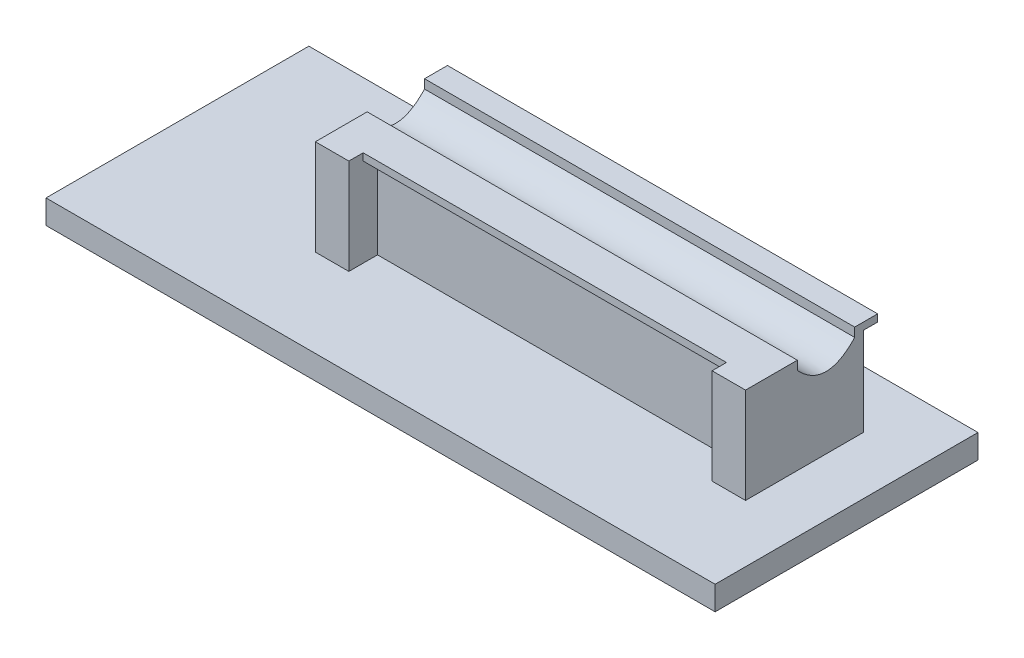
ISO-10303-21;
HEADER;
FILE_DESCRIPTION(('STEP AP214'),'2;1');
FILE_NAME('part.step','',(''),(''),'','','');
FILE_SCHEMA(('AUTOMOTIVE_DESIGN { 1 0 10303 214 1 1 1 1 }'));
ENDSEC;
DATA;
#1=APPLICATION_CONTEXT('core data for automotive mechanical design processes');
#2=APPLICATION_PROTOCOL_DEFINITION('international standard','automotive_design',2000,#1);
#3=PRODUCT_CONTEXT('',#1,'mechanical');
#4=PRODUCT('Part','Part','',(#3));
#5=PRODUCT_RELATED_PRODUCT_CATEGORY('part','',(#4));
#6=PRODUCT_DEFINITION_FORMATION('','',#4);
#7=PRODUCT_DEFINITION_CONTEXT('part definition',#1,'design');
#8=PRODUCT_DEFINITION('design','',#6,#7);
#9=PRODUCT_DEFINITION_SHAPE('','',#8);
#10=(LENGTH_UNIT() NAMED_UNIT(*) SI_UNIT(.MILLI.,.METRE.));
#11=(NAMED_UNIT(*) PLANE_ANGLE_UNIT() SI_UNIT($,.RADIAN.));
#12=(NAMED_UNIT(*) SI_UNIT($,.STERADIAN.) SOLID_ANGLE_UNIT());
#13=UNCERTAINTY_MEASURE_WITH_UNIT(LENGTH_MEASURE(1.E-05),#10,'distance_accuracy_value','');
#14=(GEOMETRIC_REPRESENTATION_CONTEXT(3) GLOBAL_UNCERTAINTY_ASSIGNED_CONTEXT((#13)) GLOBAL_UNIT_ASSIGNED_CONTEXT((#10,
#11,#12)) REPRESENTATION_CONTEXT('',''));
#15=CARTESIAN_POINT('',(0.,0.,0.));
#16=DIRECTION('',(0.,0.,1.));
#17=DIRECTION('',(1.,0.,0.));
#18=AXIS2_PLACEMENT_3D('',#15,#16,#17);
#19=CARTESIAN_POINT('',(-900.,100.,93.185));
#20=DIRECTION('',(0.,0.,1.));
#21=DIRECTION('',(0.,-1.,0.));
#22=AXIS2_PLACEMENT_3D('',#19,#20,#21);
#23=PLANE('',#22);
#24=DIRECTION('',(0.,-1.,0.));
#25=VECTOR('',#24,1.);
#26=CARTESIAN_POINT('',(-70.0000000000001,100.,93.185));
#27=LINE('',#26,#25);
#28=CARTESIAN_POINT('',(-70.0000000000001,85.,93.185));
#29=VERTEX_POINT('',#28);
#30=CARTESIAN_POINT('',(-70.,-100.,93.185));
#31=VERTEX_POINT('',#30);
#32=EDGE_CURVE('E387',#29,#31,#27,.T.);
#33=ORIENTED_EDGE('',*,*,#32,.F.);
#34=DIRECTION('',(1.,0.,0.));
#35=VECTOR('',#34,1.);
#36=CARTESIAN_POINT('',(-830.,85.,93.185));
#37=LINE('',#36,#35);
#38=CARTESIAN_POINT('',(-830.,85.,93.185));
#39=VERTEX_POINT('',#38);
#40=EDGE_CURVE('E200',#39,#29,#37,.T.);
#41=ORIENTED_EDGE('',*,*,#40,.F.);
#42=DIRECTION('',(0.,1.,0.));
#43=VECTOR('',#42,1.);
#44=CARTESIAN_POINT('',(-830.,100.,93.185));
#45=LINE('',#44,#43);
#46=CARTESIAN_POINT('',(-830.,-100.,93.185));
#47=VERTEX_POINT('',#46);
#48=EDGE_CURVE('E205',#47,#39,#45,.T.);
#49=ORIENTED_EDGE('',*,*,#48,.F.);
#50=DIRECTION('',(1.,0.,0.));
#51=VECTOR('',#50,1.);
#52=CARTESIAN_POINT('',(-900.,-100.,93.185));
#53=LINE('',#52,#51);
#54=EDGE_CURVE('E48',#47,#31,#53,.T.);
#55=ORIENTED_EDGE('',*,*,#54,.T.);
#56=EDGE_LOOP('',(#33,#41,#49,#55));
#57=FACE_BOUND('',#56,.T.);
#58=ADVANCED_FACE('F44',(#57),#23,.T.);
#59=CARTESIAN_POINT('',(-70.0000000000001,100.,153.185));
#60=DIRECTION('',(1.,0.,0.));
#61=DIRECTION('',(0.,1.,0.));
#62=AXIS2_PLACEMENT_3D('',#59,#60,#61);
#63=PLANE('',#62);
#64=DIRECTION('',(0.,0.,-1.));
#65=VECTOR('',#64,1.);
#66=CARTESIAN_POINT('',(-70.0000000000001,85.,123.185));
#67=LINE('',#66,#65);
#68=CARTESIAN_POINT('',(-70.0000000000001,85.,123.185));
#69=VERTEX_POINT('',#68);
#70=EDGE_CURVE('E189',#69,#29,#67,.T.);
#71=ORIENTED_EDGE('',*,*,#70,.T.);
#72=ORIENTED_EDGE('',*,*,#32,.T.);
#73=DIRECTION('',(0.,0.,-1.));
#74=VECTOR('',#73,1.);
#75=CARTESIAN_POINT('',(-70.,-100.,153.185));
#76=LINE('',#75,#74);
#77=CARTESIAN_POINT('',(-70.,-100.,153.185));
#78=VERTEX_POINT('',#77);
#79=EDGE_CURVE('E358',#78,#31,#76,.T.);
#80=ORIENTED_EDGE('',*,*,#79,.F.);
#81=DIRECTION('',(0.,-1.,0.));
#82=VECTOR('',#81,1.);
#83=CARTESIAN_POINT('',(-70.0000000000001,100.,153.185));
#84=LINE('',#83,#82);
#85=CARTESIAN_POINT('',(-70.0000000000001,100.,153.185));
#86=VERTEX_POINT('',#85);
#87=EDGE_CURVE('E393',#86,#78,#84,.T.);
#88=ORIENTED_EDGE('',*,*,#87,.F.);
#89=DIRECTION('',(0.,0.,-1.));
#90=VECTOR('',#89,1.);
#91=CARTESIAN_POINT('',(-70.0000000000001,100.,153.185));
#92=LINE('',#91,#90);
#93=CARTESIAN_POINT('',(-70.0000000000001,100.,123.185));
#94=VERTEX_POINT('',#93);
#95=EDGE_CURVE('E404',#86,#94,#92,.T.);
#96=ORIENTED_EDGE('',*,*,#95,.T.);
#97=DIRECTION('',(0.,1.,0.));
#98=VECTOR('',#97,1.);
#99=CARTESIAN_POINT('',(-70.0000000000001,100.,123.185));
#100=LINE('',#99,#98);
#101=EDGE_CURVE('E192',#69,#94,#100,.T.);
#102=ORIENTED_EDGE('',*,*,#101,.F.);
#103=EDGE_LOOP('',(#71,#72,#80,#88,#96,#102));
#104=FACE_BOUND('',#103,.T.);
#105=ADVANCED_FACE('F295',(#104),#63,.F.);
#106=CARTESIAN_POINT('',(-830.,100.,153.185));
#107=DIRECTION('',(-1.,0.,0.));
#108=DIRECTION('',(0.,0.,1.));
#109=AXIS2_PLACEMENT_3D('',#106,#107,#108);
#110=PLANE('',#109);
#111=DIRECTION('',(0.,0.,-1.));
#112=VECTOR('',#111,1.);
#113=CARTESIAN_POINT('',(-830.,85.,123.185));
#114=LINE('',#113,#112);
#115=CARTESIAN_POINT('',(-830.,85.,123.185));
#116=VERTEX_POINT('',#115);
#117=EDGE_CURVE('E186',#116,#39,#114,.T.);
#118=ORIENTED_EDGE('',*,*,#117,.F.);
#119=DIRECTION('',(0.,-1.,0.));
#120=VECTOR('',#119,1.);
#121=CARTESIAN_POINT('',(-830.,100.,123.185));
#122=LINE('',#121,#120);
#123=CARTESIAN_POINT('',(-830.,100.,123.185));
#124=VERTEX_POINT('',#123);
#125=EDGE_CURVE('E193',#124,#116,#122,.T.);
#126=ORIENTED_EDGE('',*,*,#125,.F.);
#127=DIRECTION('',(0.,0.,-1.));
#128=VECTOR('',#127,1.);
#129=CARTESIAN_POINT('',(-830.,100.,153.185));
#130=LINE('',#129,#128);
#131=CARTESIAN_POINT('',(-830.,100.,153.185));
#132=VERTEX_POINT('',#131);
#133=EDGE_CURVE('E424',#132,#124,#130,.T.);
#134=ORIENTED_EDGE('',*,*,#133,.F.);
#135=DIRECTION('',(0.,1.,0.));
#136=VECTOR('',#135,1.);
#137=CARTESIAN_POINT('',(-830.,100.,153.185));
#138=LINE('',#137,#136);
#139=CARTESIAN_POINT('',(-830.,-100.,153.185));
#140=VERTEX_POINT('',#139);
#141=EDGE_CURVE('E389',#140,#132,#138,.T.);
#142=ORIENTED_EDGE('',*,*,#141,.F.);
#143=DIRECTION('',(0.,0.,-1.));
#144=VECTOR('',#143,1.);
#145=CARTESIAN_POINT('',(-830.,-100.,153.185));
#146=LINE('',#145,#144);
#147=EDGE_CURVE('E422',#140,#47,#146,.T.);
#148=ORIENTED_EDGE('',*,*,#147,.T.);
#149=ORIENTED_EDGE('',*,*,#48,.T.);
#150=EDGE_LOOP('',(#118,#126,#134,#142,#148,#149));
#151=FACE_BOUND('',#150,.T.);
#152=ADVANCED_FACE('F203',(#151),#110,.F.);
#153=CARTESIAN_POINT('',(-900.,100.,-93.185));
#154=DIRECTION('',(0.,0.,-1.));
#155=DIRECTION('',(0.,1.,0.));
#156=AXIS2_PLACEMENT_3D('',#153,#154,#155);
#157=PLANE('',#156);
#158=DIRECTION('',(0.,1.,0.));
#159=VECTOR('',#158,1.);
#160=CARTESIAN_POINT('',(-900.,100.,-93.185));
#161=LINE('',#160,#159);
#162=CARTESIAN_POINT('',(-900.,-100.,-93.185));
#163=VERTEX_POINT('',#162);
#164=CARTESIAN_POINT('',(-900.,85.,-93.185));
#165=VERTEX_POINT('',#164);
#166=EDGE_CURVE('E339',#163,#165,#161,.T.);
#167=ORIENTED_EDGE('',*,*,#166,.T.);
#168=DIRECTION('',(-1.,0.,0.));
#169=VECTOR('',#168,1.);
#170=CARTESIAN_POINT('',(0.,85.,-93.185));
#171=LINE('',#170,#169);
#172=CARTESIAN_POINT('',(0.,85.,-93.185));
#173=VERTEX_POINT('',#172);
#174=EDGE_CURVE('E207',#173,#165,#171,.T.);
#175=ORIENTED_EDGE('',*,*,#174,.F.);
#176=DIRECTION('',(0.,1.,0.));
#177=VECTOR('',#176,1.);
#178=CARTESIAN_POINT('',(0.,100.,-93.185));
#179=LINE('',#178,#177);
#180=CARTESIAN_POINT('',(0.,-100.,-93.185));
#181=VERTEX_POINT('',#180);
#182=EDGE_CURVE('E354',#181,#173,#179,.T.);
#183=ORIENTED_EDGE('',*,*,#182,.F.);
#184=DIRECTION('',(1.,0.,0.));
#185=VECTOR('',#184,1.);
#186=CARTESIAN_POINT('',(-900.,-100.,-93.185));
#187=LINE('',#186,#185);
#188=EDGE_CURVE('E11',#163,#181,#187,.T.);
#189=ORIENTED_EDGE('',*,*,#188,.F.);
#190=EDGE_LOOP('',(#167,#175,#183,#189));
#191=FACE_BOUND('',#190,.T.);
#192=ADVANCED_FACE('F46',(#191),#157,.T.);
#193=CARTESIAN_POINT('',(-900.,100.,93.185));
#194=DIRECTION('',(0.,1.,0.));
#195=DIRECTION('',(0.,0.,1.));
#196=AXIS2_PLACEMENT_3D('',#193,#194,#195);
#197=PLANE('',#196);
#198=DIRECTION('',(1.,0.,0.));
#199=VECTOR('',#198,1.);
#200=CARTESIAN_POINT('',(-900.,100.,-75.185));
#201=LINE('',#200,#199);
#202=CARTESIAN_POINT('',(-900.,100.,-75.185));
#203=VERTEX_POINT('',#202);
#204=CARTESIAN_POINT('',(0.,100.,-75.185));
#205=VERTEX_POINT('',#204);
#206=EDGE_CURVE('E480',#203,#205,#201,.T.);
#207=ORIENTED_EDGE('',*,*,#206,.T.);
#208=DIRECTION('',(0.,0.,1.));
#209=VECTOR('',#208,1.);
#210=CARTESIAN_POINT('',(0.,100.,93.185));
#211=LINE('',#210,#209);
#212=CARTESIAN_POINT('',(0.,100.,-123.185));
#213=VERTEX_POINT('',#212);
#214=EDGE_CURVE('E359',#213,#205,#211,.T.);
#215=ORIENTED_EDGE('',*,*,#214,.F.);
#216=DIRECTION('',(1.,0.,0.));
#217=VECTOR('',#216,1.);
#218=CARTESIAN_POINT('',(0.,100.,-123.185));
#219=LINE('',#218,#217);
#220=CARTESIAN_POINT('',(-900.,100.,-123.185));
#221=VERTEX_POINT('',#220);
#222=EDGE_CURVE('E227',#221,#213,#219,.T.);
#223=ORIENTED_EDGE('',*,*,#222,.F.);
#224=DIRECTION('',(0.,0.,1.));
#225=VECTOR('',#224,1.);
#226=CARTESIAN_POINT('',(-900.,100.,93.185));
#227=LINE('',#226,#225);
#228=EDGE_CURVE('E338',#221,#203,#227,.T.);
#229=ORIENTED_EDGE('',*,*,#228,.T.);
#230=EDGE_LOOP('',(#207,#215,#223,#229));
#231=FACE_BOUND('',#230,.T.);
#232=ADVANCED_FACE('F318',(#231),#197,.T.);
#233=DIRECTION('',(1.,0.,0.));
#234=VECTOR('',#233,1.);
#235=CARTESIAN_POINT('',(-900.,100.,44.815));
#236=LINE('',#235,#234);
#237=CARTESIAN_POINT('',(-900.,100.,44.815));
#238=VERTEX_POINT('',#237);
#239=CARTESIAN_POINT('',(0.,100.,44.815));
#240=VERTEX_POINT('',#239);
#241=EDGE_CURVE('E68',#238,#240,#236,.T.);
#242=ORIENTED_EDGE('',*,*,#241,.F.);
#243=CARTESIAN_POINT('',(-900.,100.,153.185));
#244=VERTEX_POINT('',#243);
#245=EDGE_CURVE('E327',#238,#244,#227,.T.);
#246=ORIENTED_EDGE('',*,*,#245,.T.);
#247=DIRECTION('',(-1.,0.,0.));
#248=VECTOR('',#247,1.);
#249=CARTESIAN_POINT('',(-900.,100.,153.185));
#250=LINE('',#249,#248);
#251=EDGE_CURVE('E381',#132,#244,#250,.T.);
#252=ORIENTED_EDGE('',*,*,#251,.F.);
#253=ORIENTED_EDGE('',*,*,#133,.T.);
#254=DIRECTION('',(-1.,0.,0.));
#255=VECTOR('',#254,1.);
#256=CARTESIAN_POINT('',(-830.,100.,123.185));
#257=LINE('',#256,#255);
#258=EDGE_CURVE('E60',#94,#124,#257,.T.);
#259=ORIENTED_EDGE('',*,*,#258,.F.);
#260=ORIENTED_EDGE('',*,*,#95,.F.);
#261=DIRECTION('',(-1.,0.,0.));
#262=VECTOR('',#261,1.);
#263=CARTESIAN_POINT('',(-70.0000000000001,100.,153.185));
#264=LINE('',#263,#262);
#265=CARTESIAN_POINT('',(0.,100.,153.185));
#266=VERTEX_POINT('',#265);
#267=EDGE_CURVE('E401',#266,#86,#264,.T.);
#268=ORIENTED_EDGE('',*,*,#267,.F.);
#269=EDGE_CURVE('E330',#240,#266,#211,.T.);
#270=ORIENTED_EDGE('',*,*,#269,.F.);
#271=EDGE_LOOP('',(#242,#246,#252,#253,#259,#260,#268,#270));
#272=FACE_BOUND('',#271,.T.);
#273=ADVANCED_FACE('F310',(#272),#197,.T.);
#274=CARTESIAN_POINT('',(-900.,0.,0.));
#275=DIRECTION('',(1.,0.,0.));
#276=DIRECTION('',(0.,0.,-1.));
#277=AXIS2_PLACEMENT_3D('',#274,#275,#276);
#278=PLANE('',#277);
#279=CARTESIAN_POINT('',(-900.,81.2420917557449,44.815));
#280=CARTESIAN_POINT('',(-900.,17.3998710259146,-15.185));
#281=CARTESIAN_POINT('',(-900.,81.2420917557449,-75.185));
#282=B_SPLINE_CURVE_WITH_KNOTS('',2,(#279,#280,#281),.UNSPECIFIED.,.F.,.F.,(3,3),(0.,1.),.UNSPECIFIED.);
#283=CARTESIAN_POINT('',(-900.,81.2420917557449,44.815));
#284=VERTEX_POINT('',#283);
#285=CARTESIAN_POINT('',(-900.,81.2420917557449,-75.185));
#286=VERTEX_POINT('',#285);
#287=EDGE_CURVE('E243',#284,#286,#282,.T.);
#288=ORIENTED_EDGE('',*,*,#287,.T.);
#289=DIRECTION('',(0.,1.,0.));
#290=VECTOR('',#289,1.);
#291=CARTESIAN_POINT('',(-900.,100.,-75.185));
#292=LINE('',#291,#290);
#293=EDGE_CURVE('E251',#286,#203,#292,.T.);
#294=ORIENTED_EDGE('',*,*,#293,.T.);
#295=ORIENTED_EDGE('',*,*,#228,.F.);
#296=DIRECTION('',(0.,1.,0.));
#297=VECTOR('',#296,1.);
#298=CARTESIAN_POINT('',(-900.,100.,-123.185));
#299=LINE('',#298,#297);
#300=CARTESIAN_POINT('',(-900.,85.,-123.185));
#301=VERTEX_POINT('',#300);
#302=EDGE_CURVE('E223',#301,#221,#299,.T.);
#303=ORIENTED_EDGE('',*,*,#302,.F.);
#304=DIRECTION('',(0.,0.,1.));
#305=VECTOR('',#304,1.);
#306=CARTESIAN_POINT('',(-900.,85.,-123.185));
#307=LINE('',#306,#305);
#308=EDGE_CURVE('E230',#301,#165,#307,.T.);
#309=ORIENTED_EDGE('',*,*,#308,.T.);
#310=ORIENTED_EDGE('',*,*,#166,.F.);
#311=DIRECTION('',(0.,0.,-1.));
#312=VECTOR('',#311,1.);
#313=CARTESIAN_POINT('',(-900.,-100.,93.185));
#314=LINE('',#313,#312);
#315=CARTESIAN_POINT('',(-900.,-100.,153.185));
#316=VERTEX_POINT('',#315);
#317=EDGE_CURVE('E345',#316,#163,#314,.T.);
#318=ORIENTED_EDGE('',*,*,#317,.F.);
#319=DIRECTION('',(0.,-1.,0.));
#320=VECTOR('',#319,1.);
#321=CARTESIAN_POINT('',(-900.,100.,153.185));
#322=LINE('',#321,#320);
#323=EDGE_CURVE('E336',#244,#316,#322,.T.);
#324=ORIENTED_EDGE('',*,*,#323,.F.);
#325=ORIENTED_EDGE('',*,*,#245,.F.);
#326=DIRECTION('',(0.,-1.,0.));
#327=VECTOR('',#326,1.);
#328=CARTESIAN_POINT('',(-900.,100.,44.815));
#329=LINE('',#328,#327);
#330=EDGE_CURVE('E239',#238,#284,#329,.T.);
#331=ORIENTED_EDGE('',*,*,#330,.T.);
#332=EDGE_LOOP('',(#288,#294,#295,#303,#309,#310,#318,#324,#325,#331));
#333=FACE_BOUND('',#332,.T.);
#334=ADVANCED_FACE('F307',(#333),#278,.F.);
#335=CARTESIAN_POINT('',(0.,0.,0.));
#336=DIRECTION('',(1.,0.,0.));
#337=DIRECTION('',(0.,0.,-1.));
#338=AXIS2_PLACEMENT_3D('',#335,#336,#337);
#339=PLANE('',#338);
#340=DIRECTION('',(0.,1.,0.));
#341=VECTOR('',#340,1.);
#342=CARTESIAN_POINT('',(0.,100.,-75.185));
#343=LINE('',#342,#341);
#344=CARTESIAN_POINT('',(0.,81.2420917557449,-75.185));
#345=VERTEX_POINT('',#344);
#346=EDGE_CURVE('E244',#345,#205,#343,.T.);
#347=ORIENTED_EDGE('',*,*,#346,.F.);
#348=CARTESIAN_POINT('',(0.,81.2420917557449,44.815));
#349=CARTESIAN_POINT('',(0.,17.3998710259146,-15.185));
#350=CARTESIAN_POINT('',(0.,81.2420917557449,-75.185));
#351=B_SPLINE_CURVE_WITH_KNOTS('',2,(#348,#349,#350),.UNSPECIFIED.,.F.,.F.,(3,3),(0.,1.),.UNSPECIFIED.);
#352=CARTESIAN_POINT('',(0.,81.2420917557449,44.815));
#353=VERTEX_POINT('',#352);
#354=EDGE_CURVE('E502',#353,#345,#351,.T.);
#355=ORIENTED_EDGE('',*,*,#354,.F.);
#356=DIRECTION('',(0.,-1.,0.));
#357=VECTOR('',#356,1.);
#358=CARTESIAN_POINT('',(0.,100.,44.815));
#359=LINE('',#358,#357);
#360=EDGE_CURVE('E238',#240,#353,#359,.T.);
#361=ORIENTED_EDGE('',*,*,#360,.F.);
#362=ORIENTED_EDGE('',*,*,#269,.T.);
#363=DIRECTION('',(0.,1.,0.));
#364=VECTOR('',#363,1.);
#365=CARTESIAN_POINT('',(0.,100.,153.185));
#366=LINE('',#365,#364);
#367=CARTESIAN_POINT('',(0.,-100.,153.185));
#368=VERTEX_POINT('',#367);
#369=EDGE_CURVE('E371',#368,#266,#366,.T.);
#370=ORIENTED_EDGE('',*,*,#369,.F.);
#371=DIRECTION('',(0.,0.,-1.));
#372=VECTOR('',#371,1.);
#373=CARTESIAN_POINT('',(0.,-100.,93.185));
#374=LINE('',#373,#372);
#375=EDGE_CURVE('E347',#368,#181,#374,.T.);
#376=ORIENTED_EDGE('',*,*,#375,.T.);
#377=ORIENTED_EDGE('',*,*,#182,.T.);
#378=DIRECTION('',(0.,0.,1.));
#379=VECTOR('',#378,1.);
#380=CARTESIAN_POINT('',(0.,85.,-123.185));
#381=LINE('',#380,#379);
#382=CARTESIAN_POINT('',(0.,85.,-123.185));
#383=VERTEX_POINT('',#382);
#384=EDGE_CURVE('E235',#383,#173,#381,.T.);
#385=ORIENTED_EDGE('',*,*,#384,.F.);
#386=DIRECTION('',(0.,-1.,0.));
#387=VECTOR('',#386,1.);
#388=CARTESIAN_POINT('',(0.,100.,-123.185));
#389=LINE('',#388,#387);
#390=EDGE_CURVE('E212',#213,#383,#389,.T.);
#391=ORIENTED_EDGE('',*,*,#390,.F.);
#392=ORIENTED_EDGE('',*,*,#214,.T.);
#393=EDGE_LOOP('',(#347,#355,#361,#362,#370,#376,#377,#385,#391,#392));
#394=FACE_BOUND('',#393,.T.);
#395=ADVANCED_FACE('F302',(#394),#339,.T.);
#396=CARTESIAN_POINT('',(0.,0.,153.185));
#397=DIRECTION('',(0.,0.,1.));
#398=DIRECTION('',(1.,0.,0.));
#399=AXIS2_PLACEMENT_3D('',#396,#397,#398);
#400=PLANE('',#399);
#401=ORIENTED_EDGE('',*,*,#87,.T.);
#402=DIRECTION('',(1.,0.,0.));
#403=VECTOR('',#402,1.);
#404=CARTESIAN_POINT('',(-70.,-100.,153.185));
#405=LINE('',#404,#403);
#406=EDGE_CURVE('E396',#78,#368,#405,.T.);
#407=ORIENTED_EDGE('',*,*,#406,.T.);
#408=ORIENTED_EDGE('',*,*,#369,.T.);
#409=ORIENTED_EDGE('',*,*,#267,.T.);
#410=EDGE_LOOP('',(#401,#407,#408,#409));
#411=FACE_BOUND('',#410,.T.);
#412=ADVANCED_FACE('F298',(#411),#400,.T.);
#413=CARTESIAN_POINT('',(0.,0.,153.185));
#414=DIRECTION('',(0.,0.,1.));
#415=DIRECTION('',(1.,0.,0.));
#416=AXIS2_PLACEMENT_3D('',#413,#414,#415);
#417=PLANE('',#416);
#418=ORIENTED_EDGE('',*,*,#323,.T.);
#419=DIRECTION('',(1.,0.,0.));
#420=VECTOR('',#419,1.);
#421=CARTESIAN_POINT('',(-900.,-100.,153.185));
#422=LINE('',#421,#420);
#423=EDGE_CURVE('E379',#316,#140,#422,.T.);
#424=ORIENTED_EDGE('',*,*,#423,.T.);
#425=ORIENTED_EDGE('',*,*,#141,.T.);
#426=ORIENTED_EDGE('',*,*,#251,.T.);
#427=EDGE_LOOP('',(#418,#424,#425,#426));
#428=FACE_BOUND('',#427,.T.);
#429=ADVANCED_FACE('F277',(#428),#417,.T.);
#430=CARTESIAN_POINT('',(0.,-100.,0.));
#431=DIRECTION('',(0.,1.,0.));
#432=DIRECTION('',(0.,0.,1.));
#433=AXIS2_PLACEMENT_3D('',#430,#431,#432);
#434=PLANE('',#433);
#435=DIRECTION('',(1.,0.,0.));
#436=VECTOR('',#435,1.);
#437=CARTESIAN_POINT('',(120.,-100.,-213.185));
#438=LINE('',#437,#436);
#439=CARTESIAN_POINT('',(-1280.,-100.,-213.185));
#440=VERTEX_POINT('',#439);
#441=CARTESIAN_POINT('',(120.,-100.,-213.185));
#442=VERTEX_POINT('',#441);
#443=EDGE_CURVE('E476',#440,#442,#438,.T.);
#444=ORIENTED_EDGE('',*,*,#443,.F.);
#445=DIRECTION('',(0.,0.,-1.));
#446=VECTOR('',#445,1.);
#447=CARTESIAN_POINT('',(-1280.,-100.,-213.185));
#448=LINE('',#447,#446);
#449=CARTESIAN_POINT('',(-1280.,-100.,336.815));
#450=VERTEX_POINT('',#449);
#451=EDGE_CURVE('E466',#450,#440,#448,.T.);
#452=ORIENTED_EDGE('',*,*,#451,.F.);
#453=DIRECTION('',(-1.,0.,0.));
#454=VECTOR('',#453,1.);
#455=CARTESIAN_POINT('',(-1280.,-100.,336.815));
#456=LINE('',#455,#454);
#457=CARTESIAN_POINT('',(120.,-100.,336.815));
#458=VERTEX_POINT('',#457);
#459=EDGE_CURVE('E470',#458,#450,#456,.T.);
#460=ORIENTED_EDGE('',*,*,#459,.F.);
#461=DIRECTION('',(0.,0.,1.));
#462=VECTOR('',#461,1.);
#463=CARTESIAN_POINT('',(120.,-100.,336.815));
#464=LINE('',#463,#462);
#465=EDGE_CURVE('E473',#442,#458,#464,.T.);
#466=ORIENTED_EDGE('',*,*,#465,.F.);
#467=EDGE_LOOP('',(#444,#452,#460,#466));
#468=FACE_BOUND('',#467,.T.);
#469=ORIENTED_EDGE('',*,*,#375,.F.);
#470=ORIENTED_EDGE('',*,*,#406,.F.);
#471=ORIENTED_EDGE('',*,*,#79,.T.);
#472=ORIENTED_EDGE('',*,*,#54,.F.);
#473=ORIENTED_EDGE('',*,*,#147,.F.);
#474=ORIENTED_EDGE('',*,*,#423,.F.);
#475=ORIENTED_EDGE('',*,*,#317,.T.);
#476=ORIENTED_EDGE('',*,*,#188,.T.);
#477=EDGE_LOOP('',(#469,#470,#471,#472,#473,#474,#475,#476));
#478=FACE_BOUND('',#477,.T.);
#479=ADVANCED_FACE('F273',(#468,#478),#434,.T.);
#480=CARTESIAN_POINT('',(120.,-150.,-213.185));
#481=DIRECTION('',(0.,0.,1.));
#482=DIRECTION('',(1.,0.,0.));
#483=AXIS2_PLACEMENT_3D('',#480,#481,#482);
#484=PLANE('',#483);
#485=ORIENTED_EDGE('',*,*,#443,.T.);
#486=DIRECTION('',(0.,1.,0.));
#487=VECTOR('',#486,1.);
#488=CARTESIAN_POINT('',(120.,-150.,-213.185));
#489=LINE('',#488,#487);
#490=CARTESIAN_POINT('',(120.,-150.,-213.185));
#491=VERTEX_POINT('',#490);
#492=EDGE_CURVE('E425',#491,#442,#489,.T.);
#493=ORIENTED_EDGE('',*,*,#492,.F.);
#494=DIRECTION('',(1.,0.,0.));
#495=VECTOR('',#494,1.);
#496=CARTESIAN_POINT('',(120.,-150.,-213.185));
#497=LINE('',#496,#495);
#498=CARTESIAN_POINT('',(-1280.,-150.,-213.185));
#499=VERTEX_POINT('',#498);
#500=EDGE_CURVE('E469',#499,#491,#497,.T.);
#501=ORIENTED_EDGE('',*,*,#500,.F.);
#502=DIRECTION('',(0.,1.,0.));
#503=VECTOR('',#502,1.);
#504=CARTESIAN_POINT('',(-1280.,-150.,-213.185));
#505=LINE('',#504,#503);
#506=EDGE_CURVE('E461',#499,#440,#505,.T.);
#507=ORIENTED_EDGE('',*,*,#506,.T.);
#508=EDGE_LOOP('',(#485,#493,#501,#507));
#509=FACE_BOUND('',#508,.T.);
#510=ADVANCED_FACE('F276',(#509),#484,.F.);
#511=CARTESIAN_POINT('',(120.,-150.,336.815));
#512=DIRECTION('',(-1.,0.,0.));
#513=DIRECTION('',(0.,0.,1.));
#514=AXIS2_PLACEMENT_3D('',#511,#512,#513);
#515=PLANE('',#514);
#516=ORIENTED_EDGE('',*,*,#465,.T.);
#517=DIRECTION('',(0.,1.,0.));
#518=VECTOR('',#517,1.);
#519=CARTESIAN_POINT('',(120.,-150.,336.815));
#520=LINE('',#519,#518);
#521=CARTESIAN_POINT('',(120.,-150.,336.815));
#522=VERTEX_POINT('',#521);
#523=EDGE_CURVE('E432',#522,#458,#520,.T.);
#524=ORIENTED_EDGE('',*,*,#523,.F.);
#525=DIRECTION('',(0.,0.,1.));
#526=VECTOR('',#525,1.);
#527=CARTESIAN_POINT('',(120.,-150.,336.815));
#528=LINE('',#527,#526);
#529=EDGE_CURVE('E486',#491,#522,#528,.T.);
#530=ORIENTED_EDGE('',*,*,#529,.F.);
#531=ORIENTED_EDGE('',*,*,#492,.T.);
#532=EDGE_LOOP('',(#516,#524,#530,#531));
#533=FACE_BOUND('',#532,.T.);
#534=ADVANCED_FACE('F285',(#533),#515,.F.);
#535=CARTESIAN_POINT('',(-1280.,-150.,336.815));
#536=DIRECTION('',(0.,0.,-1.));
#537=DIRECTION('',(-1.,0.,0.));
#538=AXIS2_PLACEMENT_3D('',#535,#536,#537);
#539=PLANE('',#538);
#540=ORIENTED_EDGE('',*,*,#459,.T.);
#541=DIRECTION('',(0.,1.,0.));
#542=VECTOR('',#541,1.);
#543=CARTESIAN_POINT('',(-1280.,-150.,336.815));
#544=LINE('',#543,#542);
#545=CARTESIAN_POINT('',(-1280.,-150.,336.815));
#546=VERTEX_POINT('',#545);
#547=EDGE_CURVE('E457',#546,#450,#544,.T.);
#548=ORIENTED_EDGE('',*,*,#547,.F.);
#549=DIRECTION('',(-1.,0.,0.));
#550=VECTOR('',#549,1.);
#551=CARTESIAN_POINT('',(-1280.,-150.,336.815));
#552=LINE('',#551,#550);
#553=EDGE_CURVE('E483',#522,#546,#552,.T.);
#554=ORIENTED_EDGE('',*,*,#553,.F.);
#555=ORIENTED_EDGE('',*,*,#523,.T.);
#556=EDGE_LOOP('',(#540,#548,#554,#555));
#557=FACE_BOUND('',#556,.T.);
#558=ADVANCED_FACE('F281',(#557),#539,.F.);
#559=CARTESIAN_POINT('',(-1280.,-150.,-213.185));
#560=DIRECTION('',(1.,0.,0.));
#561=DIRECTION('',(0.,0.,-1.));
#562=AXIS2_PLACEMENT_3D('',#559,#560,#561);
#563=PLANE('',#562);
#564=ORIENTED_EDGE('',*,*,#451,.T.);
#565=ORIENTED_EDGE('',*,*,#506,.F.);
#566=DIRECTION('',(0.,0.,-1.));
#567=VECTOR('',#566,1.);
#568=CARTESIAN_POINT('',(-1280.,-150.,-213.185));
#569=LINE('',#568,#567);
#570=EDGE_CURVE('E465',#546,#499,#569,.T.);
#571=ORIENTED_EDGE('',*,*,#570,.F.);
#572=ORIENTED_EDGE('',*,*,#547,.T.);
#573=EDGE_LOOP('',(#564,#565,#571,#572));
#574=FACE_BOUND('',#573,.T.);
#575=ADVANCED_FACE('F271',(#574),#563,.F.);
#576=CARTESIAN_POINT('',(0.,-150.,0.));
#577=DIRECTION('',(0.,1.,0.));
#578=DIRECTION('',(0.,0.,1.));
#579=AXIS2_PLACEMENT_3D('',#576,#577,#578);
#580=PLANE('',#579);
#581=ORIENTED_EDGE('',*,*,#500,.T.);
#582=ORIENTED_EDGE('',*,*,#529,.T.);
#583=ORIENTED_EDGE('',*,*,#553,.T.);
#584=ORIENTED_EDGE('',*,*,#570,.T.);
#585=EDGE_LOOP('',(#581,#582,#583,#584));
#586=FACE_BOUND('',#585,.T.);
#587=ADVANCED_FACE('F268',(#586),#580,.F.);
#588=CARTESIAN_POINT('',(-900.,100.,-75.185));
#589=DIRECTION('',(0.,0.,-1.));
#590=DIRECTION('',(-1.,0.,0.));
#591=AXIS2_PLACEMENT_3D('',#588,#589,#590);
#592=PLANE('',#591);
#593=ORIENTED_EDGE('',*,*,#346,.T.);
#594=ORIENTED_EDGE('',*,*,#206,.F.);
#595=ORIENTED_EDGE('',*,*,#293,.F.);
#596=DIRECTION('',(1.,0.,0.));
#597=VECTOR('',#596,1.);
#598=CARTESIAN_POINT('',(-900.,81.2420917557449,-75.185));
#599=LINE('',#598,#597);
#600=EDGE_CURVE('E494',#286,#345,#599,.T.);
#601=ORIENTED_EDGE('',*,*,#600,.T.);
#602=EDGE_LOOP('',(#593,#594,#595,#601));
#603=FACE_BOUND('',#602,.T.);
#604=ADVANCED_FACE('F262',(#603),#592,.F.);
#605=DIRECTION('',(1.,0.,0.));
#606=VECTOR('',#605,1.);
#607=SURFACE_OF_LINEAR_EXTRUSION('',#282,#606);
#608=ORIENTED_EDGE('',*,*,#354,.T.);
#609=ORIENTED_EDGE('',*,*,#600,.F.);
#610=ORIENTED_EDGE('',*,*,#287,.F.);
#611=DIRECTION('',(1.,0.,0.));
#612=VECTOR('',#611,1.);
#613=CARTESIAN_POINT('',(-900.,81.2420917557449,44.815));
#614=LINE('',#613,#612);
#615=EDGE_CURVE('E332',#284,#353,#614,.T.);
#616=ORIENTED_EDGE('',*,*,#615,.T.);
#617=EDGE_LOOP('',(#608,#609,#610,#616));
#618=FACE_BOUND('',#617,.T.);
#619=ADVANCED_FACE('F257',(#618),#607,.F.);
#620=CARTESIAN_POINT('',(-900.,100.,44.815));
#621=DIRECTION('',(0.,0.,1.));
#622=DIRECTION('',(0.,-1.,0.));
#623=AXIS2_PLACEMENT_3D('',#620,#621,#622);
#624=PLANE('',#623);
#625=ORIENTED_EDGE('',*,*,#360,.T.);
#626=ORIENTED_EDGE('',*,*,#615,.F.);
#627=ORIENTED_EDGE('',*,*,#330,.F.);
#628=ORIENTED_EDGE('',*,*,#241,.T.);
#629=EDGE_LOOP('',(#625,#626,#627,#628));
#630=FACE_BOUND('',#629,.T.);
#631=ADVANCED_FACE('F261',(#630),#624,.F.);
#632=CARTESIAN_POINT('',(0.,85.,-123.185));
#633=DIRECTION('',(0.,1.,0.));
#634=DIRECTION('',(0.,0.,1.));
#635=AXIS2_PLACEMENT_3D('',#632,#633,#634);
#636=PLANE('',#635);
#637=ORIENTED_EDGE('',*,*,#174,.T.);
#638=ORIENTED_EDGE('',*,*,#308,.F.);
#639=DIRECTION('',(-1.,0.,0.));
#640=VECTOR('',#639,1.);
#641=CARTESIAN_POINT('',(0.,85.,-123.185));
#642=LINE('',#641,#640);
#643=EDGE_CURVE('E220',#383,#301,#642,.T.);
#644=ORIENTED_EDGE('',*,*,#643,.F.);
#645=ORIENTED_EDGE('',*,*,#384,.T.);
#646=EDGE_LOOP('',(#637,#638,#644,#645));
#647=FACE_BOUND('',#646,.T.);
#648=ADVANCED_FACE('F267',(#647),#636,.F.);
#649=CARTESIAN_POINT('',(0.,0.,-123.185));
#650=DIRECTION('',(0.,0.,-1.));
#651=DIRECTION('',(-1.,0.,0.));
#652=AXIS2_PLACEMENT_3D('',#649,#650,#651);
#653=PLANE('',#652);
#654=ORIENTED_EDGE('',*,*,#390,.T.);
#655=ORIENTED_EDGE('',*,*,#643,.T.);
#656=ORIENTED_EDGE('',*,*,#302,.T.);
#657=ORIENTED_EDGE('',*,*,#222,.T.);
#658=EDGE_LOOP('',(#654,#655,#656,#657));
#659=FACE_BOUND('',#658,.T.);
#660=ADVANCED_FACE('F522',(#659),#653,.T.);
#661=CARTESIAN_POINT('',(-830.,85.,123.185));
#662=DIRECTION('',(0.,1.,0.));
#663=DIRECTION('',(0.,0.,1.));
#664=AXIS2_PLACEMENT_3D('',#661,#662,#663);
#665=PLANE('',#664);
#666=ORIENTED_EDGE('',*,*,#40,.T.);
#667=ORIENTED_EDGE('',*,*,#70,.F.);
#668=DIRECTION('',(1.,0.,0.));
#669=VECTOR('',#668,1.);
#670=CARTESIAN_POINT('',(-830.,85.,123.185));
#671=LINE('',#670,#669);
#672=EDGE_CURVE('E183',#116,#69,#671,.T.);
#673=ORIENTED_EDGE('',*,*,#672,.F.);
#674=ORIENTED_EDGE('',*,*,#117,.T.);
#675=EDGE_LOOP('',(#666,#667,#673,#674));
#676=FACE_BOUND('',#675,.T.);
#677=ADVANCED_FACE('F184',(#676),#665,.F.);
#678=CARTESIAN_POINT('',(0.,0.,123.185));
#679=DIRECTION('',(0.,0.,1.));
#680=DIRECTION('',(1.,0.,0.));
#681=AXIS2_PLACEMENT_3D('',#678,#679,#680);
#682=PLANE('',#681);
#683=ORIENTED_EDGE('',*,*,#125,.T.);
#684=ORIENTED_EDGE('',*,*,#672,.T.);
#685=ORIENTED_EDGE('',*,*,#101,.T.);
#686=ORIENTED_EDGE('',*,*,#258,.T.);
#687=EDGE_LOOP('',(#683,#684,#685,#686));
#688=FACE_BOUND('',#687,.T.);
#689=ADVANCED_FACE('F195',(#688),#682,.T.);
#690=CLOSED_SHELL('',(#58,#105,#152,#192,#232,#273,#334,#395,#412,#429,#479,#510,#534,#558,#575,
#587,#604,#619,#631,#648,#660,#677,#689));
#691=MANIFOLD_SOLID_BREP('B2',#690);
#692=ADVANCED_BREP_SHAPE_REPRESENTATION('',(#18,#691),#14);
#693=SHAPE_DEFINITION_REPRESENTATION(#9,#692);
ENDSEC;
END-ISO-10303-21;
